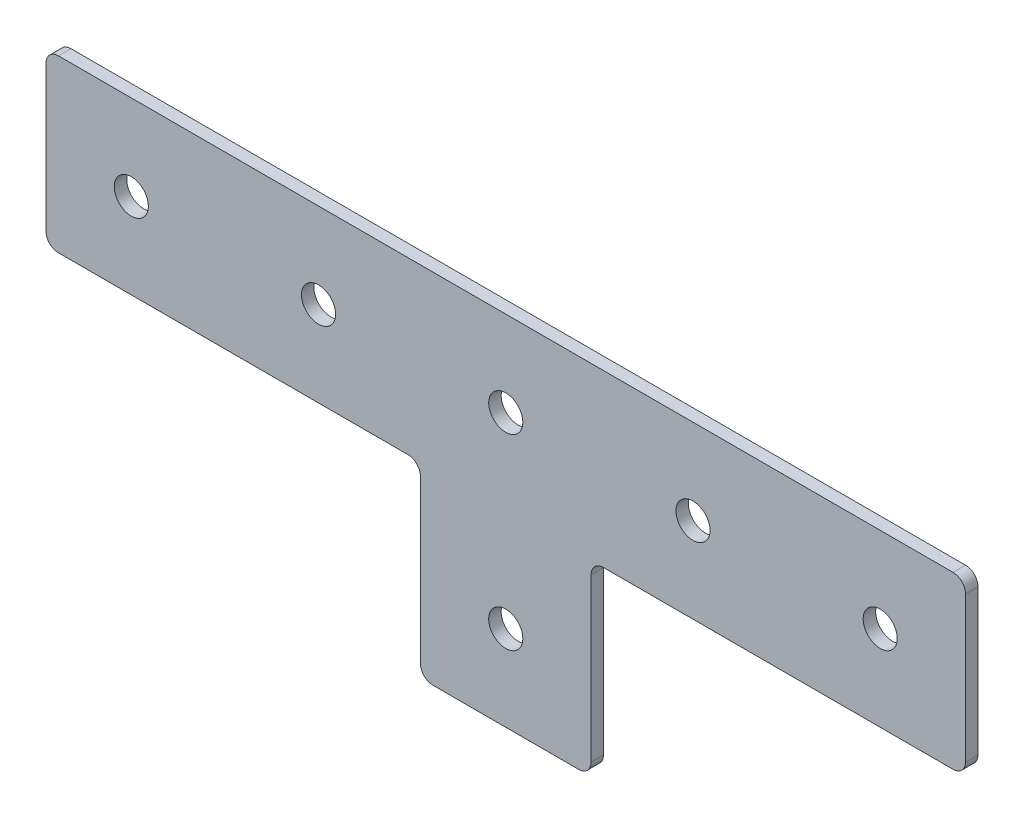
ISO-10303-21;
HEADER;
FILE_DESCRIPTION(('STEP AP214'),'2;1');
FILE_NAME('part.step','',(''),(''),'','','');
FILE_SCHEMA(('AUTOMOTIVE_DESIGN { 1 0 10303 214 1 1 1 1 }'));
ENDSEC;
DATA;
#1=APPLICATION_CONTEXT('core data for automotive mechanical design processes');
#2=APPLICATION_PROTOCOL_DEFINITION('international standard','automotive_design',2000,#1);
#3=PRODUCT_CONTEXT('',#1,'mechanical');
#4=PRODUCT('Part','Part','',(#3));
#5=PRODUCT_RELATED_PRODUCT_CATEGORY('part','',(#4));
#6=PRODUCT_DEFINITION_FORMATION('','',#4);
#7=PRODUCT_DEFINITION_CONTEXT('part definition',#1,'design');
#8=PRODUCT_DEFINITION('design','',#6,#7);
#9=PRODUCT_DEFINITION_SHAPE('','',#8);
#10=(LENGTH_UNIT() NAMED_UNIT(*) SI_UNIT(.MILLI.,.METRE.));
#11=(NAMED_UNIT(*) PLANE_ANGLE_UNIT() SI_UNIT($,.RADIAN.));
#12=(NAMED_UNIT(*) SI_UNIT($,.STERADIAN.) SOLID_ANGLE_UNIT());
#13=UNCERTAINTY_MEASURE_WITH_UNIT(LENGTH_MEASURE(1.E-05),#10,'distance_accuracy_value','');
#14=(GEOMETRIC_REPRESENTATION_CONTEXT(3) GLOBAL_UNCERTAINTY_ASSIGNED_CONTEXT((#13)) GLOBAL_UNIT_ASSIGNED_CONTEXT((#10,
#11,#12)) REPRESENTATION_CONTEXT('',''));
#15=CARTESIAN_POINT('',(0.,0.,0.));
#16=DIRECTION('',(0.,0.,1.));
#17=DIRECTION('',(1.,0.,0.));
#18=AXIS2_PLACEMENT_3D('',#15,#16,#17);
#19=CARTESIAN_POINT('',(-21.9535127194222,4.70798729377476,0.245965513819556));
#20=DIRECTION('',(0.,1.,0.));
#21=DIRECTION('',(-1.,0.,0.));
#22=AXIS2_PLACEMENT_3D('',#19,#20,#21);
#23=PLANE('',#22);
#24=DIRECTION('',(1.,0.,0.));
#25=VECTOR('',#24,1.);
#26=CARTESIAN_POINT('',(-21.9535127194222,4.70798729377476,-2.75403448618044));
#27=LINE('',#26,#25);
#28=CARTESIAN_POINT('',(-108.953512719422,4.70798729377476,-2.75403448618044));
#29=VERTEX_POINT('',#28);
#30=CARTESIAN_POINT('',(-24.9535127194222,4.70798729377476,-2.75403448618044));
#31=VERTEX_POINT('',#30);
#32=EDGE_CURVE('E223',#29,#31,#27,.T.);
#33=ORIENTED_EDGE('',*,*,#32,.T.);
#34=DIRECTION('',(0.,0.,-1.));
#35=VECTOR('',#34,1.);
#36=CARTESIAN_POINT('',(-24.9535127194222,4.70798729377476,0.245965513819556));
#37=LINE('',#36,#35);
#38=CARTESIAN_POINT('',(-24.9535127194222,4.70798729377476,0.245965513819556));
#39=VERTEX_POINT('',#38);
#40=EDGE_CURVE('E211',#31,#39,#37,.F.);
#41=ORIENTED_EDGE('',*,*,#40,.T.);
#42=DIRECTION('',(1.,0.,0.));
#43=VECTOR('',#42,1.);
#44=CARTESIAN_POINT('',(-21.9535127194222,4.70798729377476,0.245965513819556));
#45=LINE('',#44,#43);
#46=CARTESIAN_POINT('',(-108.953512719422,4.70798729377476,0.245965513819556));
#47=VERTEX_POINT('',#46);
#48=EDGE_CURVE('E158',#47,#39,#45,.T.);
#49=ORIENTED_EDGE('',*,*,#48,.F.);
#50=DIRECTION('',(0.,0.,-1.));
#51=VECTOR('',#50,1.);
#52=CARTESIAN_POINT('',(-108.953512719422,4.70798729377476,0.245965513819556));
#53=LINE('',#52,#51);
#54=EDGE_CURVE('E208',#47,#29,#53,.T.);
#55=ORIENTED_EDGE('',*,*,#54,.T.);
#56=EDGE_LOOP('',(#33,#41,#49,#55));
#57=FACE_BOUND('',#56,.T.);
#58=ADVANCED_FACE('F16',(#57),#23,.F.);
#59=CARTESIAN_POINT('',(-21.9535127194222,-40.2920127062253,0.245965513819556));
#60=DIRECTION('',(1.,0.,0.));
#61=DIRECTION('',(0.,0.,-1.));
#62=AXIS2_PLACEMENT_3D('',#59,#60,#61);
#63=PLANE('',#62);
#64=DIRECTION('',(0.,-1.,0.));
#65=VECTOR('',#64,1.);
#66=CARTESIAN_POINT('',(-21.9535127194222,-40.2920127062253,-2.75403448618044));
#67=LINE('',#66,#65);
#68=CARTESIAN_POINT('',(-21.9535127194222,1.70798729377475,-2.75403448618044));
#69=VERTEX_POINT('',#68);
#70=CARTESIAN_POINT('',(-21.9535127194222,-37.2920127062252,-2.75403448618044));
#71=VERTEX_POINT('',#70);
#72=EDGE_CURVE('E225',#69,#71,#67,.T.);
#73=ORIENTED_EDGE('',*,*,#72,.T.);
#74=DIRECTION('',(0.,0.,-1.));
#75=VECTOR('',#74,1.);
#76=CARTESIAN_POINT('',(-21.9535127194222,-37.2920127062252,0.245965513819556));
#77=LINE('',#76,#75);
#78=CARTESIAN_POINT('',(-21.9535127194222,-37.2920127062252,0.245965513819556));
#79=VERTEX_POINT('',#78);
#80=EDGE_CURVE('E206',#71,#79,#77,.F.);
#81=ORIENTED_EDGE('',*,*,#80,.T.);
#82=DIRECTION('',(0.,-1.,0.));
#83=VECTOR('',#82,1.);
#84=CARTESIAN_POINT('',(-21.9535127194222,-40.2920127062253,0.245965513819556));
#85=LINE('',#84,#83);
#86=CARTESIAN_POINT('',(-21.9535127194222,1.70798729377475,0.245965513819556));
#87=VERTEX_POINT('',#86);
#88=EDGE_CURVE('E241',#87,#79,#85,.T.);
#89=ORIENTED_EDGE('',*,*,#88,.F.);
#90=DIRECTION('',(0.,0.,-1.));
#91=VECTOR('',#90,1.);
#92=CARTESIAN_POINT('',(-21.9535127194222,1.70798729377476,-2.75403448618044));
#93=LINE('',#92,#91);
#94=EDGE_CURVE('E203',#87,#69,#93,.T.);
#95=ORIENTED_EDGE('',*,*,#94,.T.);
#96=EDGE_LOOP('',(#73,#81,#89,#95));
#97=FACE_BOUND('',#96,.T.);
#98=ADVANCED_FACE('F244',(#97),#63,.F.);
#99=CARTESIAN_POINT('',(19.0464872805779,-40.2920127062252,0.245965513819556));
#100=DIRECTION('',(0.,1.,0.));
#101=DIRECTION('',(-1.,0.,0.));
#102=AXIS2_PLACEMENT_3D('',#99,#100,#101);
#103=PLANE('',#102);
#104=DIRECTION('',(1.,0.,0.));
#105=VECTOR('',#104,1.);
#106=CARTESIAN_POINT('',(19.0464872805779,-40.2920127062252,-2.75403448618044));
#107=LINE('',#106,#105);
#108=CARTESIAN_POINT('',(-18.9535127194222,-40.2920127062253,-2.75403448618044));
#109=VERTEX_POINT('',#108);
#110=CARTESIAN_POINT('',(16.0464872805778,-40.2920127062252,-2.75403448618044));
#111=VERTEX_POINT('',#110);
#112=EDGE_CURVE('E264',#109,#111,#107,.T.);
#113=ORIENTED_EDGE('',*,*,#112,.T.);
#114=DIRECTION('',(0.,0.,-1.));
#115=VECTOR('',#114,1.);
#116=CARTESIAN_POINT('',(16.0464872805778,-40.2920127062252,0.245965513819556));
#117=LINE('',#116,#115);
#118=CARTESIAN_POINT('',(16.0464872805778,-40.2920127062252,0.245965513819556));
#119=VERTEX_POINT('',#118);
#120=EDGE_CURVE('E201',#111,#119,#117,.F.);
#121=ORIENTED_EDGE('',*,*,#120,.T.);
#122=DIRECTION('',(1.,0.,0.));
#123=VECTOR('',#122,1.);
#124=CARTESIAN_POINT('',(19.0464872805779,-40.2920127062252,0.245965513819556));
#125=LINE('',#124,#123);
#126=CARTESIAN_POINT('',(-18.9535127194222,-40.2920127062253,0.245965513819556));
#127=VERTEX_POINT('',#126);
#128=EDGE_CURVE('E246',#127,#119,#125,.T.);
#129=ORIENTED_EDGE('',*,*,#128,.F.);
#130=DIRECTION('',(0.,0.,-1.));
#131=VECTOR('',#130,1.);
#132=CARTESIAN_POINT('',(-18.9535127194222,-40.2920127062253,0.245965513819556));
#133=LINE('',#132,#131);
#134=EDGE_CURVE('E198',#127,#109,#133,.T.);
#135=ORIENTED_EDGE('',*,*,#134,.T.);
#136=EDGE_LOOP('',(#113,#121,#129,#135));
#137=FACE_BOUND('',#136,.T.);
#138=ADVANCED_FACE('F299',(#137),#103,.F.);
#139=CARTESIAN_POINT('',(19.0464872805778,4.70798729377477,0.245965513819556));
#140=DIRECTION('',(-1.,0.,0.));
#141=DIRECTION('',(0.,-1.,0.));
#142=AXIS2_PLACEMENT_3D('',#139,#140,#141);
#143=PLANE('',#142);
#144=DIRECTION('',(0.,1.,0.));
#145=VECTOR('',#144,1.);
#146=CARTESIAN_POINT('',(19.0464872805778,4.70798729377477,-2.75403448618044));
#147=LINE('',#146,#145);
#148=CARTESIAN_POINT('',(19.0464872805779,-37.2920127062252,-2.75403448618044));
#149=VERTEX_POINT('',#148);
#150=CARTESIAN_POINT('',(19.0464872805778,1.70798729377476,-2.75403448618044));
#151=VERTEX_POINT('',#150);
#152=EDGE_CURVE('E267',#149,#151,#147,.T.);
#153=ORIENTED_EDGE('',*,*,#152,.T.);
#154=DIRECTION('',(0.,0.,-1.));
#155=VECTOR('',#154,1.);
#156=CARTESIAN_POINT('',(19.0464872805778,1.70798729377476,0.245965513819556));
#157=LINE('',#156,#155);
#158=CARTESIAN_POINT('',(19.0464872805778,1.70798729377476,0.245965513819556));
#159=VERTEX_POINT('',#158);
#160=EDGE_CURVE('E196',#151,#159,#157,.F.);
#161=ORIENTED_EDGE('',*,*,#160,.T.);
#162=DIRECTION('',(0.,1.,0.));
#163=VECTOR('',#162,1.);
#164=CARTESIAN_POINT('',(19.0464872805778,4.70798729377477,0.245965513819556));
#165=LINE('',#164,#163);
#166=CARTESIAN_POINT('',(19.0464872805779,-37.2920127062252,0.245965513819556));
#167=VERTEX_POINT('',#166);
#168=EDGE_CURVE('E249',#167,#159,#165,.T.);
#169=ORIENTED_EDGE('',*,*,#168,.F.);
#170=DIRECTION('',(0.,0.,-1.));
#171=VECTOR('',#170,1.);
#172=CARTESIAN_POINT('',(19.0464872805779,-37.2920127062252,0.245965513819556));
#173=LINE('',#172,#171);
#174=EDGE_CURVE('E193',#167,#149,#173,.T.);
#175=ORIENTED_EDGE('',*,*,#174,.T.);
#176=EDGE_LOOP('',(#153,#161,#169,#175));
#177=FACE_BOUND('',#176,.T.);
#178=ADVANCED_FACE('F292',(#177),#143,.F.);
#179=CARTESIAN_POINT('',(109.046487280578,4.70798729377476,0.245965513819556));
#180=DIRECTION('',(0.,1.,0.));
#181=DIRECTION('',(-1.,0.,0.));
#182=AXIS2_PLACEMENT_3D('',#179,#180,#181);
#183=PLANE('',#182);
#184=DIRECTION('',(1.,0.,0.));
#185=VECTOR('',#184,1.);
#186=CARTESIAN_POINT('',(109.046487280578,4.70798729377476,-2.75403448618044));
#187=LINE('',#186,#185);
#188=CARTESIAN_POINT('',(22.0464872805779,4.70798729377476,-2.75403448618044));
#189=VERTEX_POINT('',#188);
#190=CARTESIAN_POINT('',(106.046487280578,4.70798729377476,-2.75403448618044));
#191=VERTEX_POINT('',#190);
#192=EDGE_CURVE('E160',#189,#191,#187,.T.);
#193=ORIENTED_EDGE('',*,*,#192,.T.);
#194=DIRECTION('',(0.,0.,-1.));
#195=VECTOR('',#194,1.);
#196=CARTESIAN_POINT('',(106.046487280578,4.70798729377476,0.245965513819556));
#197=LINE('',#196,#195);
#198=CARTESIAN_POINT('',(106.046487280578,4.70798729377476,0.245965513819556));
#199=VERTEX_POINT('',#198);
#200=EDGE_CURVE('E191',#191,#199,#197,.F.);
#201=ORIENTED_EDGE('',*,*,#200,.T.);
#202=DIRECTION('',(1.,0.,0.));
#203=VECTOR('',#202,1.);
#204=CARTESIAN_POINT('',(109.046487280578,4.70798729377476,0.245965513819556));
#205=LINE('',#204,#203);
#206=CARTESIAN_POINT('',(22.0464872805779,4.70798729377476,0.245965513819556));
#207=VERTEX_POINT('',#206);
#208=EDGE_CURVE('E256',#207,#199,#205,.T.);
#209=ORIENTED_EDGE('',*,*,#208,.F.);
#210=DIRECTION('',(0.,0.,-1.));
#211=VECTOR('',#210,1.);
#212=CARTESIAN_POINT('',(22.0464872805778,4.70798729377477,-2.75403448618044));
#213=LINE('',#212,#211);
#214=EDGE_CURVE('E188',#207,#189,#213,.T.);
#215=ORIENTED_EDGE('',*,*,#214,.T.);
#216=EDGE_LOOP('',(#193,#201,#209,#215));
#217=FACE_BOUND('',#216,.T.);
#218=ADVANCED_FACE('F273',(#217),#183,.F.);
#219=CARTESIAN_POINT('',(109.046487280578,45.7079872937747,0.245965513819556));
#220=DIRECTION('',(-1.,0.,0.));
#221=DIRECTION('',(0.,0.,1.));
#222=AXIS2_PLACEMENT_3D('',#219,#220,#221);
#223=PLANE('',#222);
#224=DIRECTION('',(0.,1.,0.));
#225=VECTOR('',#224,1.);
#226=CARTESIAN_POINT('',(109.046487280578,45.7079872937747,-2.75403448618044));
#227=LINE('',#226,#225);
#228=CARTESIAN_POINT('',(109.046487280578,7.70798729377476,-2.75403448618044));
#229=VERTEX_POINT('',#228);
#230=CARTESIAN_POINT('',(109.046487280578,42.7079872937747,-2.75403448618044));
#231=VERTEX_POINT('',#230);
#232=EDGE_CURVE('E156',#229,#231,#227,.T.);
#233=ORIENTED_EDGE('',*,*,#232,.T.);
#234=DIRECTION('',(0.,0.,-1.));
#235=VECTOR('',#234,1.);
#236=CARTESIAN_POINT('',(109.046487280578,42.7079872937747,0.245965513819556));
#237=LINE('',#236,#235);
#238=CARTESIAN_POINT('',(109.046487280578,42.7079872937747,0.245965513819556));
#239=VERTEX_POINT('',#238);
#240=EDGE_CURVE('E135',#231,#239,#237,.F.);
#241=ORIENTED_EDGE('',*,*,#240,.T.);
#242=DIRECTION('',(0.,1.,0.));
#243=VECTOR('',#242,1.);
#244=CARTESIAN_POINT('',(109.046487280578,45.7079872937747,0.245965513819556));
#245=LINE('',#244,#243);
#246=CARTESIAN_POINT('',(109.046487280578,7.70798729377476,0.245965513819556));
#247=VERTEX_POINT('',#246);
#248=EDGE_CURVE('E259',#247,#239,#245,.T.);
#249=ORIENTED_EDGE('',*,*,#248,.F.);
#250=DIRECTION('',(0.,0.,-1.));
#251=VECTOR('',#250,1.);
#252=CARTESIAN_POINT('',(109.046487280578,7.70798729377476,0.245965513819556));
#253=LINE('',#252,#251);
#254=EDGE_CURVE('E140',#247,#229,#253,.T.);
#255=ORIENTED_EDGE('',*,*,#254,.T.);
#256=EDGE_LOOP('',(#233,#241,#249,#255));
#257=FACE_BOUND('',#256,.T.);
#258=ADVANCED_FACE('F282',(#257),#223,.F.);
#259=CARTESIAN_POINT('',(-111.953512719422,45.7079872937747,0.245965513819556));
#260=DIRECTION('',(0.,-1.,0.));
#261=DIRECTION('',(0.,0.,-1.));
#262=AXIS2_PLACEMENT_3D('',#259,#260,#261);
#263=PLANE('',#262);
#264=DIRECTION('',(-1.,0.,0.));
#265=VECTOR('',#264,1.);
#266=CARTESIAN_POINT('',(-111.953512719422,45.7079872937747,0.245965513819556));
#267=LINE('',#266,#265);
#268=CARTESIAN_POINT('',(106.046487280578,45.7079872937747,0.245965513819556));
#269=VERTEX_POINT('',#268);
#270=CARTESIAN_POINT('',(-108.953512719422,45.7079872937747,0.245965513819556));
#271=VERTEX_POINT('',#270);
#272=EDGE_CURVE('E149',#269,#271,#267,.T.);
#273=ORIENTED_EDGE('',*,*,#272,.F.);
#274=DIRECTION('',(0.,0.,-1.));
#275=VECTOR('',#274,1.);
#276=CARTESIAN_POINT('',(106.046487280578,45.7079872937747,0.245965513819556));
#277=LINE('',#276,#275);
#278=CARTESIAN_POINT('',(106.046487280578,45.7079872937747,-2.75403448618044));
#279=VERTEX_POINT('',#278);
#280=EDGE_CURVE('E134',#269,#279,#277,.T.);
#281=ORIENTED_EDGE('',*,*,#280,.T.);
#282=DIRECTION('',(-1.,0.,0.));
#283=VECTOR('',#282,1.);
#284=CARTESIAN_POINT('',(-111.953512719422,45.7079872937747,-2.75403448618044));
#285=LINE('',#284,#283);
#286=CARTESIAN_POINT('',(-108.953512719422,45.7079872937747,-2.75403448618044));
#287=VERTEX_POINT('',#286);
#288=EDGE_CURVE('E147',#279,#287,#285,.T.);
#289=ORIENTED_EDGE('',*,*,#288,.T.);
#290=DIRECTION('',(0.,0.,-1.));
#291=VECTOR('',#290,1.);
#292=CARTESIAN_POINT('',(-108.953512719422,45.7079872937747,0.245965513819556));
#293=LINE('',#292,#291);
#294=EDGE_CURVE('E151',#287,#271,#293,.F.);
#295=ORIENTED_EDGE('',*,*,#294,.T.);
#296=EDGE_LOOP('',(#273,#281,#289,#295));
#297=FACE_BOUND('',#296,.T.);
#298=ADVANCED_FACE('F146',(#297),#263,.F.);
#299=CARTESIAN_POINT('',(-111.953512719422,4.70798729377476,0.245965513819556));
#300=DIRECTION('',(1.,0.,0.));
#301=DIRECTION('',(0.,0.,-1.));
#302=AXIS2_PLACEMENT_3D('',#299,#300,#301);
#303=PLANE('',#302);
#304=DIRECTION('',(0.,-1.,0.));
#305=VECTOR('',#304,1.);
#306=CARTESIAN_POINT('',(-111.953512719422,4.70798729377476,-2.75403448618044));
#307=LINE('',#306,#305);
#308=CARTESIAN_POINT('',(-111.953512719422,42.7079872937747,-2.75403448618044));
#309=VERTEX_POINT('',#308);
#310=CARTESIAN_POINT('',(-111.953512719422,7.70798729377476,-2.75403448618044));
#311=VERTEX_POINT('',#310);
#312=EDGE_CURVE('E155',#309,#311,#307,.T.);
#313=ORIENTED_EDGE('',*,*,#312,.T.);
#314=DIRECTION('',(0.,0.,-1.));
#315=VECTOR('',#314,1.);
#316=CARTESIAN_POINT('',(-111.953512719422,7.70798729377476,0.245965513819556));
#317=LINE('',#316,#315);
#318=CARTESIAN_POINT('',(-111.953512719422,7.70798729377476,0.245965513819556));
#319=VERTEX_POINT('',#318);
#320=EDGE_CURVE('E31',#311,#319,#317,.F.);
#321=ORIENTED_EDGE('',*,*,#320,.T.);
#322=DIRECTION('',(0.,-1.,0.));
#323=VECTOR('',#322,1.);
#324=CARTESIAN_POINT('',(-111.953512719422,4.70798729377476,0.245965513819556));
#325=LINE('',#324,#323);
#326=CARTESIAN_POINT('',(-111.953512719422,42.7079872937747,0.245965513819556));
#327=VERTEX_POINT('',#326);
#328=EDGE_CURVE('E164',#327,#319,#325,.T.);
#329=ORIENTED_EDGE('',*,*,#328,.F.);
#330=DIRECTION('',(0.,0.,-1.));
#331=VECTOR('',#330,1.);
#332=CARTESIAN_POINT('',(-111.953512719422,42.7079872937747,0.245965513819556));
#333=LINE('',#332,#331);
#334=EDGE_CURVE('E213',#327,#309,#333,.T.);
#335=ORIENTED_EDGE('',*,*,#334,.T.);
#336=EDGE_LOOP('',(#313,#321,#329,#335));
#337=FACE_BOUND('',#336,.T.);
#338=ADVANCED_FACE('F290',(#337),#303,.F.);
#339=CARTESIAN_POINT('',(-111.953512719422,4.70798729377476,0.245965513819556));
#340=DIRECTION('',(0.,0.,-1.));
#341=DIRECTION('',(-1.,0.,0.));
#342=AXIS2_PLACEMENT_3D('',#339,#340,#341);
#343=PLANE('',#342);
#344=CARTESIAN_POINT('',(-91.4535127194222,25.2079872937748,0.245965513819556));
#345=DIRECTION('',(0.,0.,1.));
#346=DIRECTION('',(1.,0.,0.));
#347=AXIS2_PLACEMENT_3D('',#344,#345,#346);
#348=CIRCLE('',#347,4.1);
#349=CARTESIAN_POINT('',(-87.3535127194222,25.2079872937748,0.245965513819556));
#350=VERTEX_POINT('',#349);
#351=EDGE_CURVE('E370',#350,#350,#348,.T.);
#352=ORIENTED_EDGE('',*,*,#351,.F.);
#353=EDGE_LOOP('',(#352));
#354=FACE_BOUND('',#353,.T.);
#355=CARTESIAN_POINT('',(-1.45351271942218,25.2079872937748,0.245965513819556));
#356=DIRECTION('',(0.,0.,1.));
#357=DIRECTION('',(1.,0.,0.));
#358=AXIS2_PLACEMENT_3D('',#355,#356,#357);
#359=CIRCLE('',#358,4.1);
#360=CARTESIAN_POINT('',(2.64648728057782,25.2079872937748,0.245965513819556));
#361=VERTEX_POINT('',#360);
#362=EDGE_CURVE('E375',#361,#361,#359,.T.);
#363=ORIENTED_EDGE('',*,*,#362,.F.);
#364=EDGE_LOOP('',(#363));
#365=FACE_BOUND('',#364,.T.);
#366=CARTESIAN_POINT('',(-46.4535127194222,25.2079872937748,0.245965513819556));
#367=DIRECTION('',(0.,0.,1.));
#368=DIRECTION('',(1.,0.,0.));
#369=AXIS2_PLACEMENT_3D('',#366,#367,#368);
#370=CIRCLE('',#369,4.1);
#371=CARTESIAN_POINT('',(-42.3535127194222,25.2079872937748,0.245965513819556));
#372=VERTEX_POINT('',#371);
#373=EDGE_CURVE('E383',#372,#372,#370,.T.);
#374=ORIENTED_EDGE('',*,*,#373,.F.);
#375=EDGE_LOOP('',(#374));
#376=FACE_BOUND('',#375,.T.);
#377=CARTESIAN_POINT('',(43.5464872805778,25.2079872937748,0.245965513819556));
#378=DIRECTION('',(0.,0.,1.));
#379=DIRECTION('',(-1.,0.,0.));
#380=AXIS2_PLACEMENT_3D('',#377,#378,#379);
#381=CIRCLE('',#380,4.10000000000001);
#382=CARTESIAN_POINT('',(39.4464872805778,25.2079872937748,0.245965513819556));
#383=VERTEX_POINT('',#382);
#384=EDGE_CURVE('E389',#383,#383,#381,.T.);
#385=ORIENTED_EDGE('',*,*,#384,.F.);
#386=EDGE_LOOP('',(#385));
#387=FACE_BOUND('',#386,.T.);
#388=CARTESIAN_POINT('',(88.5464872805778,25.2079872937748,0.245965513819556));
#389=DIRECTION('',(0.,0.,1.));
#390=DIRECTION('',(-1.,0.,0.));
#391=AXIS2_PLACEMENT_3D('',#388,#389,#390);
#392=CIRCLE('',#391,4.10000000000001);
#393=CARTESIAN_POINT('',(84.4464872805778,25.2079872937748,0.245965513819556));
#394=VERTEX_POINT('',#393);
#395=EDGE_CURVE('E395',#394,#394,#392,.T.);
#396=ORIENTED_EDGE('',*,*,#395,.F.);
#397=EDGE_LOOP('',(#396));
#398=FACE_BOUND('',#397,.T.);
#399=CARTESIAN_POINT('',(-1.45351271942216,-19.7920127062252,0.245965513819556));
#400=DIRECTION('',(0.,0.,1.));
#401=DIRECTION('',(1.,0.,0.));
#402=AXIS2_PLACEMENT_3D('',#399,#400,#401);
#403=CIRCLE('',#402,4.09999999999999);
#404=CARTESIAN_POINT('',(2.64648728057782,-19.7920127062252,0.245965513819556));
#405=VERTEX_POINT('',#404);
#406=EDGE_CURVE('E400',#405,#405,#403,.T.);
#407=ORIENTED_EDGE('',*,*,#406,.F.);
#408=EDGE_LOOP('',(#407));
#409=FACE_BOUND('',#408,.T.);
#410=ORIENTED_EDGE('',*,*,#248,.T.);
#411=CARTESIAN_POINT('',(106.046487280578,42.7079872937747,0.245965513819556));
#412=DIRECTION('',(0.,0.,-1.));
#413=DIRECTION('',(-1.,0.,0.));
#414=AXIS2_PLACEMENT_3D('',#411,#412,#413);
#415=CIRCLE('',#414,3.);
#416=EDGE_CURVE('E186',#239,#269,#415,.F.);
#417=ORIENTED_EDGE('',*,*,#416,.T.);
#418=ORIENTED_EDGE('',*,*,#272,.T.);
#419=CARTESIAN_POINT('',(-108.953512719422,42.7079872937747,0.245965513819556));
#420=DIRECTION('',(0.,0.,-1.));
#421=DIRECTION('',(-1.,0.,0.));
#422=AXIS2_PLACEMENT_3D('',#419,#420,#421);
#423=CIRCLE('',#422,3.);
#424=EDGE_CURVE('E38',#271,#327,#423,.F.);
#425=ORIENTED_EDGE('',*,*,#424,.T.);
#426=ORIENTED_EDGE('',*,*,#328,.T.);
#427=CARTESIAN_POINT('',(-108.953512719422,7.70798729377476,0.245965513819556));
#428=DIRECTION('',(0.,0.,-1.));
#429=DIRECTION('',(-1.,0.,0.));
#430=AXIS2_PLACEMENT_3D('',#427,#428,#429);
#431=CIRCLE('',#430,3.);
#432=EDGE_CURVE('E178',#319,#47,#431,.F.);
#433=ORIENTED_EDGE('',*,*,#432,.T.);
#434=ORIENTED_EDGE('',*,*,#48,.T.);
#435=CARTESIAN_POINT('',(-24.9535127194222,1.70798729377476,0.245965513819556));
#436=DIRECTION('',(0.,0.,-1.));
#437=DIRECTION('',(-1.,0.,0.));
#438=AXIS2_PLACEMENT_3D('',#435,#436,#437);
#439=CIRCLE('',#438,3.);
#440=EDGE_CURVE('E10',#39,#87,#439,.T.);
#441=ORIENTED_EDGE('',*,*,#440,.T.);
#442=ORIENTED_EDGE('',*,*,#88,.T.);
#443=CARTESIAN_POINT('',(-18.9535127194222,-37.2920127062252,0.245965513819556));
#444=DIRECTION('',(0.,0.,-1.));
#445=DIRECTION('',(-1.,0.,0.));
#446=AXIS2_PLACEMENT_3D('',#443,#444,#445);
#447=CIRCLE('',#446,3.);
#448=EDGE_CURVE('E180',#79,#127,#447,.F.);
#449=ORIENTED_EDGE('',*,*,#448,.T.);
#450=ORIENTED_EDGE('',*,*,#128,.T.);
#451=CARTESIAN_POINT('',(16.0464872805778,-37.2920127062252,0.245965513819556));
#452=DIRECTION('',(0.,0.,-1.));
#453=DIRECTION('',(-1.,0.,0.));
#454=AXIS2_PLACEMENT_3D('',#451,#452,#453);
#455=CIRCLE('',#454,3.);
#456=EDGE_CURVE('E182',#119,#167,#455,.F.);
#457=ORIENTED_EDGE('',*,*,#456,.T.);
#458=ORIENTED_EDGE('',*,*,#168,.T.);
#459=CARTESIAN_POINT('',(22.0464872805778,1.70798729377476,0.245965513819556));
#460=DIRECTION('',(0.,0.,-1.));
#461=DIRECTION('',(-1.,0.,0.));
#462=AXIS2_PLACEMENT_3D('',#459,#460,#461);
#463=CIRCLE('',#462,3.);
#464=EDGE_CURVE('E219',#159,#207,#463,.T.);
#465=ORIENTED_EDGE('',*,*,#464,.T.);
#466=ORIENTED_EDGE('',*,*,#208,.T.);
#467=CARTESIAN_POINT('',(106.046487280578,7.70798729377476,0.245965513819556));
#468=DIRECTION('',(0.,0.,-1.));
#469=DIRECTION('',(-1.,0.,0.));
#470=AXIS2_PLACEMENT_3D('',#467,#468,#469);
#471=CIRCLE('',#470,3.);
#472=EDGE_CURVE('E184',#199,#247,#471,.F.);
#473=ORIENTED_EDGE('',*,*,#472,.T.);
#474=EDGE_LOOP('',(#410,#417,#418,#425,#426,#433,#434,#441,#442,#449,#450,#457,#458,#465,#466,#473));
#475=FACE_BOUND('',#474,.T.);
#476=ADVANCED_FACE('F240',(#354,#365,#376,#387,#398,#409,#475),#343,.F.);
#477=CARTESIAN_POINT('',(-111.953512719422,4.70798729377476,-2.75403448618044));
#478=DIRECTION('',(0.,0.,-1.));
#479=DIRECTION('',(-1.,0.,0.));
#480=AXIS2_PLACEMENT_3D('',#477,#478,#479);
#481=PLANE('',#480);
#482=CARTESIAN_POINT('',(-91.4535127194222,25.2079872937748,-2.75403448618044));
#483=DIRECTION('',(0.,0.,1.));
#484=DIRECTION('',(1.,0.,0.));
#485=AXIS2_PLACEMENT_3D('',#482,#483,#484);
#486=CIRCLE('',#485,4.1);
#487=CARTESIAN_POINT('',(-87.3535127194222,25.2079872937748,-2.75403448618044));
#488=VERTEX_POINT('',#487);
#489=EDGE_CURVE('E233',#488,#488,#486,.T.);
#490=ORIENTED_EDGE('',*,*,#489,.T.);
#491=EDGE_LOOP('',(#490));
#492=FACE_BOUND('',#491,.T.);
#493=CARTESIAN_POINT('',(-1.45351271942218,25.2079872937748,-2.75403448618044));
#494=DIRECTION('',(0.,0.,1.));
#495=DIRECTION('',(1.,0.,0.));
#496=AXIS2_PLACEMENT_3D('',#493,#494,#495);
#497=CIRCLE('',#496,4.1);
#498=CARTESIAN_POINT('',(2.64648728057782,25.2079872937748,-2.75403448618044));
#499=VERTEX_POINT('',#498);
#500=EDGE_CURVE('E371',#499,#499,#497,.T.);
#501=ORIENTED_EDGE('',*,*,#500,.T.);
#502=EDGE_LOOP('',(#501));
#503=FACE_BOUND('',#502,.T.);
#504=CARTESIAN_POINT('',(-46.4535127194222,25.2079872937748,-2.75403448618044));
#505=DIRECTION('',(0.,0.,1.));
#506=DIRECTION('',(1.,0.,0.));
#507=AXIS2_PLACEMENT_3D('',#504,#505,#506);
#508=CIRCLE('',#507,4.1);
#509=CARTESIAN_POINT('',(-42.3535127194222,25.2079872937748,-2.75403448618044));
#510=VERTEX_POINT('',#509);
#511=EDGE_CURVE('E380',#510,#510,#508,.T.);
#512=ORIENTED_EDGE('',*,*,#511,.T.);
#513=EDGE_LOOP('',(#512));
#514=FACE_BOUND('',#513,.T.);
#515=CARTESIAN_POINT('',(43.5464872805778,25.2079872937748,-2.75403448618044));
#516=DIRECTION('',(0.,0.,1.));
#517=DIRECTION('',(-1.,0.,0.));
#518=AXIS2_PLACEMENT_3D('',#515,#516,#517);
#519=CIRCLE('',#518,4.10000000000001);
#520=CARTESIAN_POINT('',(39.4464872805778,25.2079872937748,-2.75403448618044));
#521=VERTEX_POINT('',#520);
#522=EDGE_CURVE('E386',#521,#521,#519,.T.);
#523=ORIENTED_EDGE('',*,*,#522,.T.);
#524=EDGE_LOOP('',(#523));
#525=FACE_BOUND('',#524,.T.);
#526=CARTESIAN_POINT('',(88.5464872805778,25.2079872937748,-2.75403448618044));
#527=DIRECTION('',(0.,0.,1.));
#528=DIRECTION('',(-1.,0.,0.));
#529=AXIS2_PLACEMENT_3D('',#526,#527,#528);
#530=CIRCLE('',#529,4.10000000000001);
#531=CARTESIAN_POINT('',(84.4464872805778,25.2079872937748,-2.75403448618044));
#532=VERTEX_POINT('',#531);
#533=EDGE_CURVE('E392',#532,#532,#530,.T.);
#534=ORIENTED_EDGE('',*,*,#533,.T.);
#535=EDGE_LOOP('',(#534));
#536=FACE_BOUND('',#535,.T.);
#537=CARTESIAN_POINT('',(-1.45351271942216,-19.7920127062252,-2.75403448618044));
#538=DIRECTION('',(0.,0.,1.));
#539=DIRECTION('',(1.,0.,0.));
#540=AXIS2_PLACEMENT_3D('',#537,#538,#539);
#541=CIRCLE('',#540,4.09999999999999);
#542=CARTESIAN_POINT('',(2.64648728057782,-19.7920127062252,-2.75403448618044));
#543=VERTEX_POINT('',#542);
#544=EDGE_CURVE('E398',#543,#543,#541,.T.);
#545=ORIENTED_EDGE('',*,*,#544,.T.);
#546=EDGE_LOOP('',(#545));
#547=FACE_BOUND('',#546,.T.);
#548=ORIENTED_EDGE('',*,*,#288,.F.);
#549=CARTESIAN_POINT('',(106.046487280578,42.7079872937747,-2.75403448618044));
#550=DIRECTION('',(0.,0.,-1.));
#551=DIRECTION('',(-1.,0.,0.));
#552=AXIS2_PLACEMENT_3D('',#549,#550,#551);
#553=CIRCLE('',#552,3.);
#554=EDGE_CURVE('E130',#279,#231,#553,.T.);
#555=ORIENTED_EDGE('',*,*,#554,.T.);
#556=ORIENTED_EDGE('',*,*,#232,.F.);
#557=CARTESIAN_POINT('',(106.046487280578,7.70798729377476,-2.75403448618044));
#558=DIRECTION('',(0.,0.,-1.));
#559=DIRECTION('',(-1.,0.,0.));
#560=AXIS2_PLACEMENT_3D('',#557,#558,#559);
#561=CIRCLE('',#560,3.);
#562=EDGE_CURVE('E141',#229,#191,#561,.T.);
#563=ORIENTED_EDGE('',*,*,#562,.T.);
#564=ORIENTED_EDGE('',*,*,#192,.F.);
#565=CARTESIAN_POINT('',(22.0464872805778,1.70798729377476,-2.75403448618044));
#566=DIRECTION('',(0.,0.,-1.));
#567=DIRECTION('',(-1.,0.,0.));
#568=AXIS2_PLACEMENT_3D('',#565,#566,#567);
#569=CIRCLE('',#568,3.);
#570=EDGE_CURVE('E217',#189,#151,#569,.F.);
#571=ORIENTED_EDGE('',*,*,#570,.T.);
#572=ORIENTED_EDGE('',*,*,#152,.F.);
#573=CARTESIAN_POINT('',(16.0464872805778,-37.2920127062252,-2.75403448618044));
#574=DIRECTION('',(0.,0.,-1.));
#575=DIRECTION('',(-1.,0.,0.));
#576=AXIS2_PLACEMENT_3D('',#573,#574,#575);
#577=CIRCLE('',#576,3.);
#578=EDGE_CURVE('E171',#149,#111,#577,.T.);
#579=ORIENTED_EDGE('',*,*,#578,.T.);
#580=ORIENTED_EDGE('',*,*,#112,.F.);
#581=CARTESIAN_POINT('',(-18.9535127194222,-37.2920127062252,-2.75403448618044));
#582=DIRECTION('',(0.,0.,-1.));
#583=DIRECTION('',(-1.,0.,0.));
#584=AXIS2_PLACEMENT_3D('',#581,#582,#583);
#585=CIRCLE('',#584,3.);
#586=EDGE_CURVE('E169',#109,#71,#585,.T.);
#587=ORIENTED_EDGE('',*,*,#586,.T.);
#588=ORIENTED_EDGE('',*,*,#72,.F.);
#589=CARTESIAN_POINT('',(-24.9535127194222,1.70798729377476,-2.75403448618044));
#590=DIRECTION('',(0.,0.,-1.));
#591=DIRECTION('',(-1.,0.,0.));
#592=AXIS2_PLACEMENT_3D('',#589,#590,#591);
#593=CIRCLE('',#592,3.);
#594=EDGE_CURVE('E24',#69,#31,#593,.F.);
#595=ORIENTED_EDGE('',*,*,#594,.T.);
#596=ORIENTED_EDGE('',*,*,#32,.F.);
#597=CARTESIAN_POINT('',(-108.953512719422,7.70798729377476,-2.75403448618044));
#598=DIRECTION('',(0.,0.,-1.));
#599=DIRECTION('',(-1.,0.,0.));
#600=AXIS2_PLACEMENT_3D('',#597,#598,#599);
#601=CIRCLE('',#600,3.);
#602=EDGE_CURVE('E167',#29,#311,#601,.T.);
#603=ORIENTED_EDGE('',*,*,#602,.T.);
#604=ORIENTED_EDGE('',*,*,#312,.F.);
#605=CARTESIAN_POINT('',(-108.953512719422,42.7079872937747,-2.75403448618044));
#606=DIRECTION('',(0.,0.,-1.));
#607=DIRECTION('',(-1.,0.,0.));
#608=AXIS2_PLACEMENT_3D('',#605,#606,#607);
#609=CIRCLE('',#608,3.);
#610=EDGE_CURVE('E150',#309,#287,#609,.T.);
#611=ORIENTED_EDGE('',*,*,#610,.T.);
#612=EDGE_LOOP('',(#548,#555,#556,#563,#564,#571,#572,#579,#580,#587,#588,#595,#596,#603,#604,#611));
#613=FACE_BOUND('',#612,.T.);
#614=ADVANCED_FACE('F153',(#492,#503,#514,#525,#536,#547,#613),#481,.T.);
#615=CARTESIAN_POINT('',(106.046487280578,42.7079872937747,0.245965513819556));
#616=DIRECTION('',(0.,0.,-1.));
#617=DIRECTION('',(-1.,0.,0.));
#618=AXIS2_PLACEMENT_3D('',#615,#616,#617);
#619=CYLINDRICAL_SURFACE('',#618,3.);
#620=ORIENTED_EDGE('',*,*,#416,.F.);
#621=ORIENTED_EDGE('',*,*,#240,.F.);
#622=ORIENTED_EDGE('',*,*,#554,.F.);
#623=ORIENTED_EDGE('',*,*,#280,.F.);
#624=EDGE_LOOP('',(#620,#621,#622,#623));
#625=FACE_BOUND('',#624,.T.);
#626=ADVANCED_FACE('F133',(#625),#619,.T.);
#627=CARTESIAN_POINT('',(106.046487280578,7.70798729377476,0.245965513819556));
#628=DIRECTION('',(0.,0.,-1.));
#629=DIRECTION('',(-1.,0.,0.));
#630=AXIS2_PLACEMENT_3D('',#627,#628,#629);
#631=CYLINDRICAL_SURFACE('',#630,3.);
#632=ORIENTED_EDGE('',*,*,#472,.F.);
#633=ORIENTED_EDGE('',*,*,#200,.F.);
#634=ORIENTED_EDGE('',*,*,#562,.F.);
#635=ORIENTED_EDGE('',*,*,#254,.F.);
#636=EDGE_LOOP('',(#632,#633,#634,#635));
#637=FACE_BOUND('',#636,.T.);
#638=ADVANCED_FACE('F278',(#637),#631,.T.);
#639=CARTESIAN_POINT('',(22.0464872805778,1.70798729377476,0.245965513819556));
#640=DIRECTION('',(0.,0.,1.));
#641=DIRECTION('',(1.,0.,0.));
#642=AXIS2_PLACEMENT_3D('',#639,#640,#641);
#643=CYLINDRICAL_SURFACE('',#642,3.);
#644=ORIENTED_EDGE('',*,*,#464,.F.);
#645=ORIENTED_EDGE('',*,*,#160,.F.);
#646=ORIENTED_EDGE('',*,*,#570,.F.);
#647=ORIENTED_EDGE('',*,*,#214,.F.);
#648=EDGE_LOOP('',(#644,#645,#646,#647));
#649=FACE_BOUND('',#648,.T.);
#650=ADVANCED_FACE('F307',(#649),#643,.F.);
#651=CARTESIAN_POINT('',(16.0464872805778,-37.2920127062252,0.245965513819556));
#652=DIRECTION('',(0.,0.,-1.));
#653=DIRECTION('',(-1.,0.,0.));
#654=AXIS2_PLACEMENT_3D('',#651,#652,#653);
#655=CYLINDRICAL_SURFACE('',#654,3.);
#656=ORIENTED_EDGE('',*,*,#456,.F.);
#657=ORIENTED_EDGE('',*,*,#120,.F.);
#658=ORIENTED_EDGE('',*,*,#578,.F.);
#659=ORIENTED_EDGE('',*,*,#174,.F.);
#660=EDGE_LOOP('',(#656,#657,#658,#659));
#661=FACE_BOUND('',#660,.T.);
#662=ADVANCED_FACE('F310',(#661),#655,.T.);
#663=CARTESIAN_POINT('',(-18.9535127194222,-37.2920127062252,0.245965513819556));
#664=DIRECTION('',(0.,0.,-1.));
#665=DIRECTION('',(-1.,0.,0.));
#666=AXIS2_PLACEMENT_3D('',#663,#664,#665);
#667=CYLINDRICAL_SURFACE('',#666,3.);
#668=ORIENTED_EDGE('',*,*,#448,.F.);
#669=ORIENTED_EDGE('',*,*,#80,.F.);
#670=ORIENTED_EDGE('',*,*,#586,.F.);
#671=ORIENTED_EDGE('',*,*,#134,.F.);
#672=EDGE_LOOP('',(#668,#669,#670,#671));
#673=FACE_BOUND('',#672,.T.);
#674=ADVANCED_FACE('F314',(#673),#667,.T.);
#675=CARTESIAN_POINT('',(-24.9535127194222,1.70798729377476,0.245965513819556));
#676=DIRECTION('',(0.,0.,1.));
#677=DIRECTION('',(1.,0.,0.));
#678=AXIS2_PLACEMENT_3D('',#675,#676,#677);
#679=CYLINDRICAL_SURFACE('',#678,3.);
#680=ORIENTED_EDGE('',*,*,#440,.F.);
#681=ORIENTED_EDGE('',*,*,#40,.F.);
#682=ORIENTED_EDGE('',*,*,#594,.F.);
#683=ORIENTED_EDGE('',*,*,#94,.F.);
#684=EDGE_LOOP('',(#680,#681,#682,#683));
#685=FACE_BOUND('',#684,.T.);
#686=ADVANCED_FACE('F236',(#685),#679,.F.);
#687=CARTESIAN_POINT('',(-108.953512719422,7.70798729377476,0.245965513819556));
#688=DIRECTION('',(0.,0.,-1.));
#689=DIRECTION('',(-1.,0.,0.));
#690=AXIS2_PLACEMENT_3D('',#687,#688,#689);
#691=CYLINDRICAL_SURFACE('',#690,3.);
#692=ORIENTED_EDGE('',*,*,#432,.F.);
#693=ORIENTED_EDGE('',*,*,#320,.F.);
#694=ORIENTED_EDGE('',*,*,#602,.F.);
#695=ORIENTED_EDGE('',*,*,#54,.F.);
#696=EDGE_LOOP('',(#692,#693,#694,#695));
#697=FACE_BOUND('',#696,.T.);
#698=ADVANCED_FACE('F320',(#697),#691,.T.);
#699=CARTESIAN_POINT('',(-108.953512719422,42.7079872937747,0.245965513819556));
#700=DIRECTION('',(0.,0.,-1.));
#701=DIRECTION('',(-1.,0.,0.));
#702=AXIS2_PLACEMENT_3D('',#699,#700,#701);
#703=CYLINDRICAL_SURFACE('',#702,3.);
#704=ORIENTED_EDGE('',*,*,#424,.F.);
#705=ORIENTED_EDGE('',*,*,#294,.F.);
#706=ORIENTED_EDGE('',*,*,#610,.F.);
#707=ORIENTED_EDGE('',*,*,#334,.F.);
#708=EDGE_LOOP('',(#704,#705,#706,#707));
#709=FACE_BOUND('',#708,.T.);
#710=ADVANCED_FACE('F18',(#709),#703,.T.);
#711=CARTESIAN_POINT('',(-1.45351271942216,-19.7920127062252,-2.75403448618044));
#712=DIRECTION('',(0.,0.,1.));
#713=DIRECTION('',(1.,0.,0.));
#714=AXIS2_PLACEMENT_3D('',#711,#712,#713);
#715=CYLINDRICAL_SURFACE('',#714,4.09999999999999);
#716=ORIENTED_EDGE('',*,*,#544,.F.);
#717=EDGE_LOOP('',(#716));
#718=FACE_BOUND('',#717,.T.);
#719=ORIENTED_EDGE('',*,*,#406,.T.);
#720=EDGE_LOOP('',(#719));
#721=FACE_BOUND('',#720,.T.);
#722=ADVANCED_FACE('F326',(#718,#721),#715,.F.);
#723=CARTESIAN_POINT('',(88.5464872805778,25.2079872937748,-2.75403448618044));
#724=DIRECTION('',(0.,0.,1.));
#725=DIRECTION('',(1.,0.,0.));
#726=AXIS2_PLACEMENT_3D('',#723,#724,#725);
#727=CYLINDRICAL_SURFACE('',#726,4.10000000000001);
#728=ORIENTED_EDGE('',*,*,#533,.F.);
#729=EDGE_LOOP('',(#728));
#730=FACE_BOUND('',#729,.T.);
#731=ORIENTED_EDGE('',*,*,#395,.T.);
#732=EDGE_LOOP('',(#731));
#733=FACE_BOUND('',#732,.T.);
#734=ADVANCED_FACE('F343',(#730,#733),#727,.F.);
#735=CARTESIAN_POINT('',(43.5464872805778,25.2079872937748,-2.75403448618044));
#736=DIRECTION('',(0.,0.,1.));
#737=DIRECTION('',(1.,0.,0.));
#738=AXIS2_PLACEMENT_3D('',#735,#736,#737);
#739=CYLINDRICAL_SURFACE('',#738,4.10000000000001);
#740=ORIENTED_EDGE('',*,*,#522,.F.);
#741=EDGE_LOOP('',(#740));
#742=FACE_BOUND('',#741,.T.);
#743=ORIENTED_EDGE('',*,*,#384,.T.);
#744=EDGE_LOOP('',(#743));
#745=FACE_BOUND('',#744,.T.);
#746=ADVANCED_FACE('F347',(#742,#745),#739,.F.);
#747=CARTESIAN_POINT('',(-46.4535127194222,25.2079872937748,-2.75403448618044));
#748=DIRECTION('',(0.,0.,1.));
#749=DIRECTION('',(1.,0.,0.));
#750=AXIS2_PLACEMENT_3D('',#747,#748,#749);
#751=CYLINDRICAL_SURFACE('',#750,4.1);
#752=ORIENTED_EDGE('',*,*,#511,.F.);
#753=EDGE_LOOP('',(#752));
#754=FACE_BOUND('',#753,.T.);
#755=ORIENTED_EDGE('',*,*,#373,.T.);
#756=EDGE_LOOP('',(#755));
#757=FACE_BOUND('',#756,.T.);
#758=ADVANCED_FACE('F351',(#754,#757),#751,.F.);
#759=CARTESIAN_POINT('',(-1.45351271942218,25.2079872937748,-2.75403448618044));
#760=DIRECTION('',(0.,0.,1.));
#761=DIRECTION('',(1.,0.,0.));
#762=AXIS2_PLACEMENT_3D('',#759,#760,#761);
#763=CYLINDRICAL_SURFACE('',#762,4.1);
#764=ORIENTED_EDGE('',*,*,#500,.F.);
#765=EDGE_LOOP('',(#764));
#766=FACE_BOUND('',#765,.T.);
#767=ORIENTED_EDGE('',*,*,#362,.T.);
#768=EDGE_LOOP('',(#767));
#769=FACE_BOUND('',#768,.T.);
#770=ADVANCED_FACE('F355',(#766,#769),#763,.F.);
#771=CARTESIAN_POINT('',(-91.4535127194222,25.2079872937748,-2.75403448618044));
#772=DIRECTION('',(0.,0.,1.));
#773=DIRECTION('',(1.,0.,0.));
#774=AXIS2_PLACEMENT_3D('',#771,#772,#773);
#775=CYLINDRICAL_SURFACE('',#774,4.1);
#776=ORIENTED_EDGE('',*,*,#489,.F.);
#777=EDGE_LOOP('',(#776));
#778=FACE_BOUND('',#777,.T.);
#779=ORIENTED_EDGE('',*,*,#351,.T.);
#780=EDGE_LOOP('',(#779));
#781=FACE_BOUND('',#780,.T.);
#782=ADVANCED_FACE('F359',(#778,#781),#775,.F.);
#783=CLOSED_SHELL('',(#58,#98,#138,#178,#218,#258,#298,#338,#476,#614,#626,#638,#650,#662,#674,
#686,#698,#710,#722,#734,#746,#758,#770,#782));
#784=MANIFOLD_SOLID_BREP('B1',#783);
#785=ADVANCED_BREP_SHAPE_REPRESENTATION('',(#18,#784),#14);
#786=SHAPE_DEFINITION_REPRESENTATION(#9,#785);
ENDSEC;
END-ISO-10303-21;
